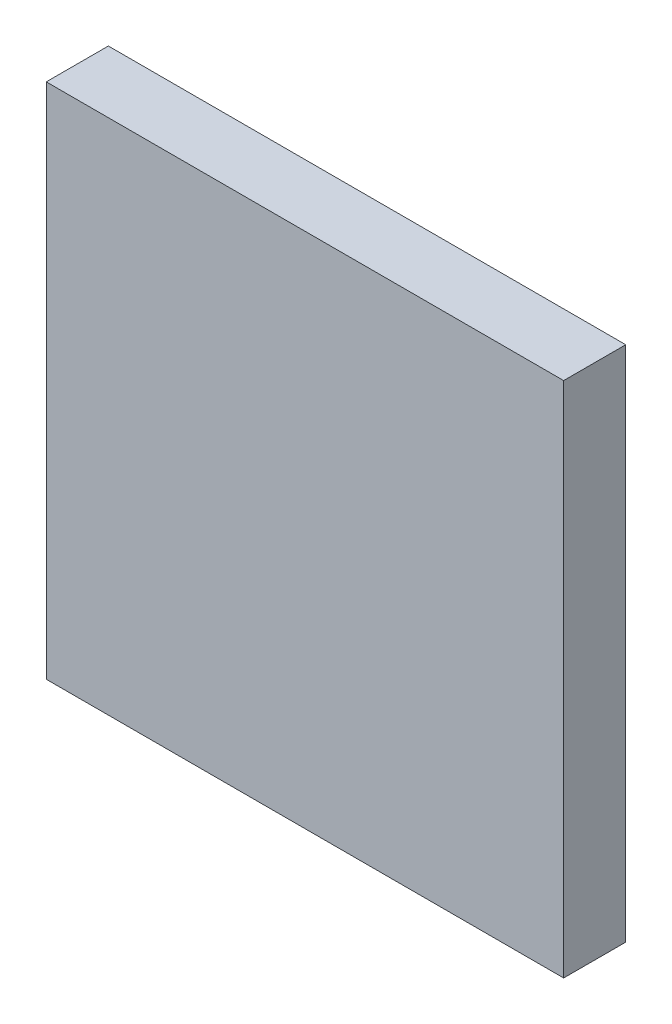
ISO-10303-21;
HEADER;
FILE_DESCRIPTION(('STEP AP214'),'2;1');
FILE_NAME('part.step','',(''),(''),'','','');
FILE_SCHEMA(('AUTOMOTIVE_DESIGN { 1 0 10303 214 1 1 1 1 }'));
ENDSEC;
DATA;
#1=APPLICATION_CONTEXT('core data for automotive mechanical design processes');
#2=APPLICATION_PROTOCOL_DEFINITION('international standard','automotive_design',2000,#1);
#3=PRODUCT_CONTEXT('',#1,'mechanical');
#4=PRODUCT('Part','Part','',(#3));
#5=PRODUCT_RELATED_PRODUCT_CATEGORY('part','',(#4));
#6=PRODUCT_DEFINITION_FORMATION('','',#4);
#7=PRODUCT_DEFINITION_CONTEXT('part definition',#1,'design');
#8=PRODUCT_DEFINITION('design','',#6,#7);
#9=PRODUCT_DEFINITION_SHAPE('','',#8);
#10=(LENGTH_UNIT() NAMED_UNIT(*) SI_UNIT(.MILLI.,.METRE.));
#11=(NAMED_UNIT(*) PLANE_ANGLE_UNIT() SI_UNIT($,.RADIAN.));
#12=(NAMED_UNIT(*) SI_UNIT($,.STERADIAN.) SOLID_ANGLE_UNIT());
#13=UNCERTAINTY_MEASURE_WITH_UNIT(LENGTH_MEASURE(1.E-05),#10,'distance_accuracy_value','');
#14=(GEOMETRIC_REPRESENTATION_CONTEXT(3) GLOBAL_UNCERTAINTY_ASSIGNED_CONTEXT((#13)) GLOBAL_UNIT_ASSIGNED_CONTEXT((#10,
#11,#12)) REPRESENTATION_CONTEXT('',''));
#15=CARTESIAN_POINT('',(0.,0.,0.));
#16=DIRECTION('',(0.,0.,1.));
#17=DIRECTION('',(1.,0.,0.));
#18=AXIS2_PLACEMENT_3D('',#15,#16,#17);
#19=CARTESIAN_POINT('',(12.5,12.5,3.));
#20=DIRECTION('',(-1.,0.,0.));
#21=DIRECTION('',(0.,-1.,0.));
#22=AXIS2_PLACEMENT_3D('',#19,#20,#21);
#23=PLANE('',#22);
#24=DIRECTION('',(0.,1.,0.));
#25=VECTOR('',#24,1.);
#26=CARTESIAN_POINT('',(12.5,12.5,0.));
#27=LINE('',#26,#25);
#28=CARTESIAN_POINT('',(12.5,-12.5,0.));
#29=VERTEX_POINT('',#28);
#30=CARTESIAN_POINT('',(12.5,12.5,0.));
#31=VERTEX_POINT('',#30);
#32=EDGE_CURVE('E98',#29,#31,#27,.T.);
#33=ORIENTED_EDGE('',*,*,#32,.T.);
#34=DIRECTION('',(0.,0.,-1.));
#35=VECTOR('',#34,1.);
#36=CARTESIAN_POINT('',(12.5,12.5,3.));
#37=LINE('',#36,#35);
#38=CARTESIAN_POINT('',(12.5,12.5,3.));
#39=VERTEX_POINT('',#38);
#40=EDGE_CURVE('E11',#39,#31,#37,.T.);
#41=ORIENTED_EDGE('',*,*,#40,.F.);
#42=DIRECTION('',(0.,1.,0.));
#43=VECTOR('',#42,1.);
#44=CARTESIAN_POINT('',(12.5,12.5,3.));
#45=LINE('',#44,#43);
#46=CARTESIAN_POINT('',(12.5,-12.5,3.));
#47=VERTEX_POINT('',#46);
#48=EDGE_CURVE('E86',#47,#39,#45,.T.);
#49=ORIENTED_EDGE('',*,*,#48,.F.);
#50=DIRECTION('',(0.,0.,-1.));
#51=VECTOR('',#50,1.);
#52=CARTESIAN_POINT('',(12.5,-12.5,3.));
#53=LINE('',#52,#51);
#54=EDGE_CURVE('E94',#47,#29,#53,.T.);
#55=ORIENTED_EDGE('',*,*,#54,.T.);
#56=EDGE_LOOP('',(#33,#41,#49,#55));
#57=FACE_BOUND('',#56,.T.);
#58=ADVANCED_FACE('F35',(#57),#23,.F.);
#59=CARTESIAN_POINT('',(-12.5,12.5,3.));
#60=DIRECTION('',(0.,-1.,0.));
#61=DIRECTION('',(0.,0.,-1.));
#62=AXIS2_PLACEMENT_3D('',#59,#60,#61);
#63=PLANE('',#62);
#64=DIRECTION('',(-1.,0.,0.));
#65=VECTOR('',#64,1.);
#66=CARTESIAN_POINT('',(-12.5,12.5,0.));
#67=LINE('',#66,#65);
#68=CARTESIAN_POINT('',(-12.5,12.5,0.));
#69=VERTEX_POINT('',#68);
#70=EDGE_CURVE('E90',#31,#69,#67,.T.);
#71=ORIENTED_EDGE('',*,*,#70,.T.);
#72=DIRECTION('',(0.,0.,-1.));
#73=VECTOR('',#72,1.);
#74=CARTESIAN_POINT('',(-12.5,12.5,3.));
#75=LINE('',#74,#73);
#76=CARTESIAN_POINT('',(-12.5,12.5,3.));
#77=VERTEX_POINT('',#76);
#78=EDGE_CURVE('E43',#77,#69,#75,.T.);
#79=ORIENTED_EDGE('',*,*,#78,.F.);
#80=DIRECTION('',(-1.,0.,0.));
#81=VECTOR('',#80,1.);
#82=CARTESIAN_POINT('',(-12.5,12.5,3.));
#83=LINE('',#82,#81);
#84=EDGE_CURVE('E81',#39,#77,#83,.T.);
#85=ORIENTED_EDGE('',*,*,#84,.F.);
#86=ORIENTED_EDGE('',*,*,#40,.T.);
#87=EDGE_LOOP('',(#71,#79,#85,#86));
#88=FACE_BOUND('',#87,.T.);
#89=ADVANCED_FACE('F89',(#88),#63,.F.);
#90=CARTESIAN_POINT('',(-12.5,12.5,3.));
#91=DIRECTION('',(1.,0.,0.));
#92=DIRECTION('',(0.,1.,0.));
#93=AXIS2_PLACEMENT_3D('',#90,#91,#92);
#94=PLANE('',#93);
#95=DIRECTION('',(0.,-1.,0.));
#96=VECTOR('',#95,1.);
#97=CARTESIAN_POINT('',(-12.5,12.5,0.));
#98=LINE('',#97,#96);
#99=CARTESIAN_POINT('',(-12.5,-12.5,0.));
#100=VERTEX_POINT('',#99);
#101=EDGE_CURVE('E68',#69,#100,#98,.T.);
#102=ORIENTED_EDGE('',*,*,#101,.T.);
#103=DIRECTION('',(0.,0.,-1.));
#104=VECTOR('',#103,1.);
#105=CARTESIAN_POINT('',(-12.5,-12.5,3.));
#106=LINE('',#105,#104);
#107=CARTESIAN_POINT('',(-12.5,-12.5,3.));
#108=VERTEX_POINT('',#107);
#109=EDGE_CURVE('E91',#108,#100,#106,.T.);
#110=ORIENTED_EDGE('',*,*,#109,.F.);
#111=DIRECTION('',(0.,-1.,0.));
#112=VECTOR('',#111,1.);
#113=CARTESIAN_POINT('',(-12.5,12.5,3.));
#114=LINE('',#113,#112);
#115=EDGE_CURVE('E84',#77,#108,#114,.T.);
#116=ORIENTED_EDGE('',*,*,#115,.F.);
#117=ORIENTED_EDGE('',*,*,#78,.T.);
#118=EDGE_LOOP('',(#102,#110,#116,#117));
#119=FACE_BOUND('',#118,.T.);
#120=ADVANCED_FACE('F92',(#119),#94,.F.);
#121=CARTESIAN_POINT('',(-12.5,-12.5,3.));
#122=DIRECTION('',(0.,1.,0.));
#123=DIRECTION('',(0.,0.,1.));
#124=AXIS2_PLACEMENT_3D('',#121,#122,#123);
#125=PLANE('',#124);
#126=DIRECTION('',(1.,0.,0.));
#127=VECTOR('',#126,1.);
#128=CARTESIAN_POINT('',(-12.5,-12.5,0.));
#129=LINE('',#128,#127);
#130=EDGE_CURVE('E74',#100,#29,#129,.T.);
#131=ORIENTED_EDGE('',*,*,#130,.T.);
#132=ORIENTED_EDGE('',*,*,#54,.F.);
#133=DIRECTION('',(1.,0.,0.));
#134=VECTOR('',#133,1.);
#135=CARTESIAN_POINT('',(-12.5,-12.5,3.));
#136=LINE('',#135,#134);
#137=EDGE_CURVE('E51',#108,#47,#136,.T.);
#138=ORIENTED_EDGE('',*,*,#137,.F.);
#139=ORIENTED_EDGE('',*,*,#109,.T.);
#140=EDGE_LOOP('',(#131,#132,#138,#139));
#141=FACE_BOUND('',#140,.T.);
#142=ADVANCED_FACE('F105',(#141),#125,.F.);
#143=CARTESIAN_POINT('',(0.,0.,3.));
#144=DIRECTION('',(0.,0.,1.));
#145=DIRECTION('',(1.,0.,0.));
#146=AXIS2_PLACEMENT_3D('',#143,#144,#145);
#147=PLANE('',#146);
#148=ORIENTED_EDGE('',*,*,#48,.T.);
#149=ORIENTED_EDGE('',*,*,#84,.T.);
#150=ORIENTED_EDGE('',*,*,#115,.T.);
#151=ORIENTED_EDGE('',*,*,#137,.T.);
#152=EDGE_LOOP('',(#148,#149,#150,#151));
#153=FACE_BOUND('',#152,.T.);
#154=ADVANCED_FACE('F82',(#153),#147,.T.);
#155=CARTESIAN_POINT('',(0.,0.,0.));
#156=DIRECTION('',(0.,0.,1.));
#157=DIRECTION('',(1.,0.,0.));
#158=AXIS2_PLACEMENT_3D('',#155,#156,#157);
#159=PLANE('',#158);
#160=ORIENTED_EDGE('',*,*,#32,.F.);
#161=ORIENTED_EDGE('',*,*,#130,.F.);
#162=ORIENTED_EDGE('',*,*,#101,.F.);
#163=ORIENTED_EDGE('',*,*,#70,.F.);
#164=EDGE_LOOP('',(#160,#161,#162,#163));
#165=FACE_BOUND('',#164,.T.);
#166=ADVANCED_FACE('F108',(#165),#159,.F.);
#167=CLOSED_SHELL('',(#58,#89,#120,#142,#154,#166));
#168=MANIFOLD_SOLID_BREP('B2',#167);
#169=ADVANCED_BREP_SHAPE_REPRESENTATION('',(#18,#168),#14);
#170=SHAPE_DEFINITION_REPRESENTATION(#9,#169);
ENDSEC;
END-ISO-10303-21;
